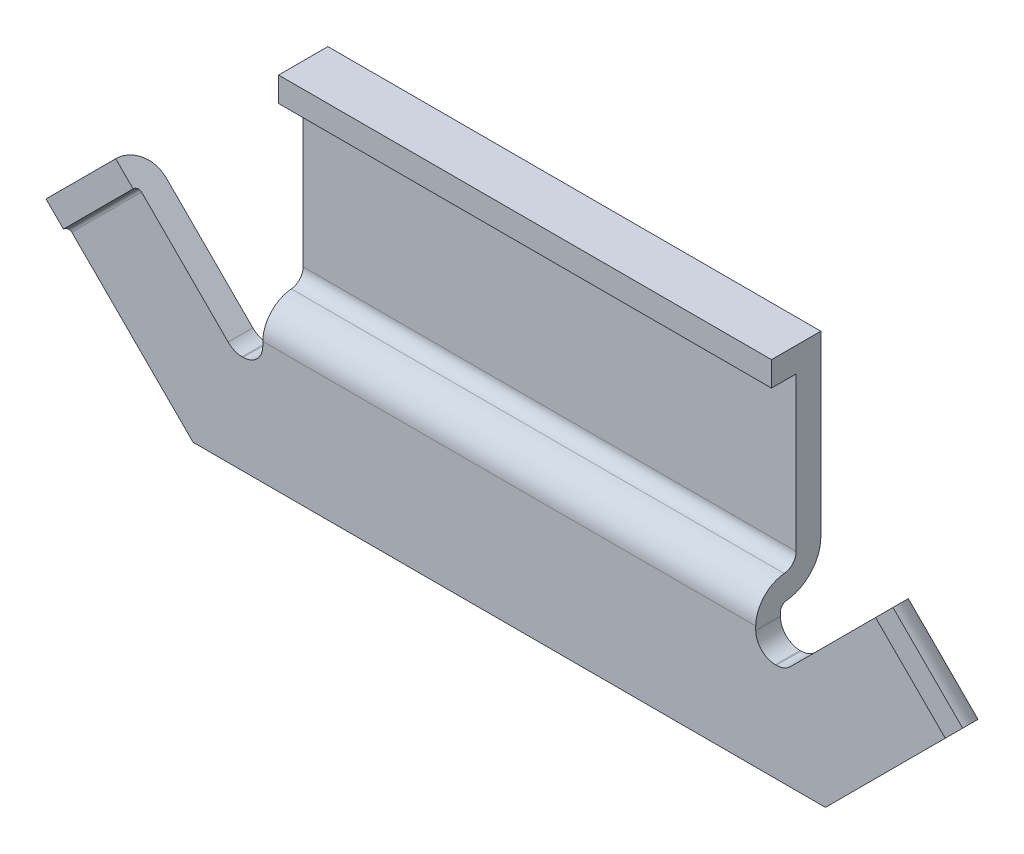
ISO-10303-21;
HEADER;
FILE_DESCRIPTION(('STEP AP214'),'2;1');
FILE_NAME('part.step','',(''),(''),'','','');
FILE_SCHEMA(('AUTOMOTIVE_DESIGN { 1 0 10303 214 1 1 1 1 }'));
ENDSEC;
DATA;
#1=APPLICATION_CONTEXT('core data for automotive mechanical design processes');
#2=APPLICATION_PROTOCOL_DEFINITION('international standard','automotive_design',2000,#1);
#3=PRODUCT_CONTEXT('',#1,'mechanical');
#4=PRODUCT('Part','Part','',(#3));
#5=PRODUCT_RELATED_PRODUCT_CATEGORY('part','',(#4));
#6=PRODUCT_DEFINITION_FORMATION('','',#4);
#7=PRODUCT_DEFINITION_CONTEXT('part definition',#1,'design');
#8=PRODUCT_DEFINITION('design','',#6,#7);
#9=PRODUCT_DEFINITION_SHAPE('','',#8);
#10=(LENGTH_UNIT() NAMED_UNIT(*) SI_UNIT(.MILLI.,.METRE.));
#11=(NAMED_UNIT(*) PLANE_ANGLE_UNIT() SI_UNIT($,.RADIAN.));
#12=(NAMED_UNIT(*) SI_UNIT($,.STERADIAN.) SOLID_ANGLE_UNIT());
#13=UNCERTAINTY_MEASURE_WITH_UNIT(LENGTH_MEASURE(1.E-05),#10,'distance_accuracy_value','');
#14=(GEOMETRIC_REPRESENTATION_CONTEXT(3) GLOBAL_UNCERTAINTY_ASSIGNED_CONTEXT((#13)) GLOBAL_UNIT_ASSIGNED_CONTEXT((#10,
#11,#12)) REPRESENTATION_CONTEXT('',''));
#15=CARTESIAN_POINT('',(0.,0.,0.));
#16=DIRECTION('',(0.,0.,1.));
#17=DIRECTION('',(1.,0.,0.));
#18=AXIS2_PLACEMENT_3D('',#15,#16,#17);
#19=CARTESIAN_POINT('',(2.5,5.75,-0.16));
#20=DIRECTION('',(0.,1.,0.));
#21=DIRECTION('',(0.,0.,1.));
#22=AXIS2_PLACEMENT_3D('',#19,#20,#21);
#23=PLANE('',#22);
#24=DIRECTION('',(1.,0.,0.));
#25=VECTOR('',#24,1.);
#26=CARTESIAN_POINT('',(2.5,5.75,-0.159999999999997));
#27=LINE('',#26,#25);
#28=CARTESIAN_POINT('',(-2.5,5.75,-0.159999999999999));
#29=VERTEX_POINT('',#28);
#30=CARTESIAN_POINT('',(2.5,5.75,-0.159999999999999));
#31=VERTEX_POINT('',#30);
#32=EDGE_CURVE('E275',#29,#31,#27,.T.);
#33=ORIENTED_EDGE('',*,*,#32,.T.);
#34=DIRECTION('',(0.,0.,1.));
#35=VECTOR('',#34,1.);
#36=CARTESIAN_POINT('',(2.5,5.75,-0.16));
#37=LINE('',#36,#35);
#38=CARTESIAN_POINT('',(2.5,5.75,0.09));
#39=VERTEX_POINT('',#38);
#40=EDGE_CURVE('E322',#39,#31,#37,.F.);
#41=ORIENTED_EDGE('',*,*,#40,.F.);
#42=DIRECTION('',(1.,0.,0.));
#43=VECTOR('',#42,1.);
#44=CARTESIAN_POINT('',(2.5,5.75,0.09));
#45=LINE('',#44,#43);
#46=CARTESIAN_POINT('',(-2.5,5.75,0.09));
#47=VERTEX_POINT('',#46);
#48=EDGE_CURVE('E310',#39,#47,#45,.F.);
#49=ORIENTED_EDGE('',*,*,#48,.T.);
#50=DIRECTION('',(0.,0.,1.));
#51=VECTOR('',#50,1.);
#52=CARTESIAN_POINT('',(-2.5,5.75,-0.16));
#53=LINE('',#52,#51);
#54=EDGE_CURVE('E317',#29,#47,#53,.T.);
#55=ORIENTED_EDGE('',*,*,#54,.F.);
#56=EDGE_LOOP('',(#33,#41,#49,#55));
#57=FACE_BOUND('',#56,.T.);
#58=ADVANCED_FACE('F17',(#57),#23,.F.);
#59=CARTESIAN_POINT('',(2.5,5.75,0.09));
#60=DIRECTION('',(0.,0.,-1.));
#61=DIRECTION('',(0.,1.,0.));
#62=AXIS2_PLACEMENT_3D('',#59,#60,#61);
#63=PLANE('',#62);
#64=ORIENTED_EDGE('',*,*,#48,.F.);
#65=DIRECTION('',(0.,1.,0.));
#66=VECTOR('',#65,1.);
#67=CARTESIAN_POINT('',(2.5,3.7,0.09));
#68=LINE('',#67,#66);
#69=CARTESIAN_POINT('',(2.5,6.,0.09));
#70=VERTEX_POINT('',#69);
#71=EDGE_CURVE('E259',#70,#39,#68,.F.);
#72=ORIENTED_EDGE('',*,*,#71,.F.);
#73=DIRECTION('',(1.,0.,0.));
#74=VECTOR('',#73,1.);
#75=CARTESIAN_POINT('',(2.5,6.,0.09));
#76=LINE('',#75,#74);
#77=CARTESIAN_POINT('',(-2.5,6.,0.09));
#78=VERTEX_POINT('',#77);
#79=EDGE_CURVE('E290',#70,#78,#76,.F.);
#80=ORIENTED_EDGE('',*,*,#79,.T.);
#81=DIRECTION('',(0.,1.,0.));
#82=VECTOR('',#81,1.);
#83=CARTESIAN_POINT('',(-2.5,5.75,0.09));
#84=LINE('',#83,#82);
#85=EDGE_CURVE('E298',#47,#78,#84,.T.);
#86=ORIENTED_EDGE('',*,*,#85,.F.);
#87=EDGE_LOOP('',(#64,#72,#80,#86));
#88=FACE_BOUND('',#87,.T.);
#89=ADVANCED_FACE('F526',(#88),#63,.F.);
#90=CARTESIAN_POINT('',(2.5,4.19,-0.16));
#91=DIRECTION('',(0.,0.,-1.));
#92=DIRECTION('',(0.,1.,0.));
#93=AXIS2_PLACEMENT_3D('',#90,#91,#92);
#94=PLANE('',#93);
#95=DIRECTION('',(1.,0.,0.));
#96=VECTOR('',#95,1.);
#97=CARTESIAN_POINT('',(2.5,4.19,-0.16000000000022));
#98=LINE('',#97,#96);
#99=CARTESIAN_POINT('',(-2.5,4.19,-0.16000000000011));
#100=VERTEX_POINT('',#99);
#101=CARTESIAN_POINT('',(2.5,4.19,-0.16000000000011));
#102=VERTEX_POINT('',#101);
#103=EDGE_CURVE('E245',#100,#102,#98,.T.);
#104=ORIENTED_EDGE('',*,*,#103,.T.);
#105=DIRECTION('',(0.,1.,0.));
#106=VECTOR('',#105,1.);
#107=CARTESIAN_POINT('',(2.5,3.7,-0.16));
#108=LINE('',#107,#106);
#109=EDGE_CURVE('E257',#31,#102,#108,.F.);
#110=ORIENTED_EDGE('',*,*,#109,.F.);
#111=ORIENTED_EDGE('',*,*,#32,.F.);
#112=DIRECTION('',(0.,-1.,0.));
#113=VECTOR('',#112,1.);
#114=CARTESIAN_POINT('',(-2.5,3.7,-0.16));
#115=LINE('',#114,#113);
#116=EDGE_CURVE('E253',#100,#29,#115,.F.);
#117=ORIENTED_EDGE('',*,*,#116,.F.);
#118=EDGE_LOOP('',(#104,#110,#111,#117));
#119=FACE_BOUND('',#118,.T.);
#120=ADVANCED_FACE('F456',(#119),#94,.F.);
#121=CARTESIAN_POINT('',(2.5,3.7,0.));
#122=DIRECTION('',(1.,0.,0.));
#123=DIRECTION('',(0.,1.,0.));
#124=AXIS2_PLACEMENT_3D('',#121,#122,#123);
#125=PLANE('',#124);
#126=CARTESIAN_POINT('',(2.5,4.19,-0.02645889627922));
#127=DIRECTION('',(1.,0.,0.));
#128=DIRECTION('',(0.,0.,-1.));
#129=AXIS2_PLACEMENT_3D('',#126,#127,#128);
#130=CIRCLE('',#129,0.133541103721);
#131=CARTESIAN_POINT('',(2.5,4.05703543639201,-0.0388545087131117));
#132=VERTEX_POINT('',#131);
#133=EDGE_CURVE('E242',#102,#132,#130,.F.);
#134=ORIENTED_EDGE('',*,*,#133,.T.);
#135=CARTESIAN_POINT('',(2.5,3.74,-0.06841011579141));
#136=DIRECTION('',(1.,0.,0.));
#137=DIRECTION('',(0.,0.,-1.));
#138=AXIS2_PLACEMENT_3D('',#135,#136,#137);
#139=CIRCLE('',#138,0.318410115791);
#140=CARTESIAN_POINT('',(2.5,3.74,0.25));
#141=VERTEX_POINT('',#140);
#142=EDGE_CURVE('E255',#132,#141,#139,.T.);
#143=ORIENTED_EDGE('',*,*,#142,.T.);
#144=DIRECTION('',(0.,1.,0.));
#145=VECTOR('',#144,1.);
#146=CARTESIAN_POINT('',(2.5,3.7,0.25));
#147=LINE('',#146,#145);
#148=CARTESIAN_POINT('',(2.5,3.7,0.25));
#149=VERTEX_POINT('',#148);
#150=EDGE_CURVE('E268',#141,#149,#147,.F.);
#151=ORIENTED_EDGE('',*,*,#150,.T.);
#152=DIRECTION('',(0.,0.,1.));
#153=VECTOR('',#152,1.);
#154=CARTESIAN_POINT('',(2.5,3.7,0.));
#155=LINE('',#154,#153);
#156=CARTESIAN_POINT('',(2.5,3.7,0.));
#157=VERTEX_POINT('',#156);
#158=EDGE_CURVE('E154',#149,#157,#155,.F.);
#159=ORIENTED_EDGE('',*,*,#158,.T.);
#160=DIRECTION('',(0.,1.,0.));
#161=VECTOR('',#160,1.);
#162=CARTESIAN_POINT('',(2.5,3.7,0.));
#163=LINE('',#162,#161);
#164=CARTESIAN_POINT('',(2.5,3.74,0.));
#165=VERTEX_POINT('',#164);
#166=EDGE_CURVE('E149',#157,#165,#163,.T.);
#167=ORIENTED_EDGE('',*,*,#166,.T.);
#168=CARTESIAN_POINT('',(2.5,3.74,-0.06841011579141));
#169=DIRECTION('',(1.,0.,0.));
#170=DIRECTION('',(0.,0.,-1.));
#171=AXIS2_PLACEMENT_3D('',#168,#169,#170);
#172=CIRCLE('',#171,0.06841011579141);
#173=CARTESIAN_POINT('',(2.5,3.80811476720731,-0.0620601212333158));
#174=VERTEX_POINT('',#173);
#175=EDGE_CURVE('E20',#165,#174,#172,.F.);
#176=ORIENTED_EDGE('',*,*,#175,.T.);
#177=CARTESIAN_POINT('',(2.5,4.19,-0.02645889627922));
#178=DIRECTION('',(1.,0.,0.));
#179=DIRECTION('',(0.,0.,-1.));
#180=AXIS2_PLACEMENT_3D('',#177,#178,#179);
#181=CIRCLE('',#180,0.383541103721);
#182=CARTESIAN_POINT('',(2.5,4.19,-0.41000000000011));
#183=VERTEX_POINT('',#182);
#184=EDGE_CURVE('E258',#174,#183,#181,.T.);
#185=ORIENTED_EDGE('',*,*,#184,.T.);
#186=DIRECTION('',(0.,-1.,0.));
#187=VECTOR('',#186,1.);
#188=CARTESIAN_POINT('',(2.5,4.19,-0.41));
#189=LINE('',#188,#187);
#190=CARTESIAN_POINT('',(2.5,6.,-0.409999999999997));
#191=VERTEX_POINT('',#190);
#192=EDGE_CURVE('E241',#183,#191,#189,.F.);
#193=ORIENTED_EDGE('',*,*,#192,.T.);
#194=DIRECTION('',(0.,0.,-1.));
#195=VECTOR('',#194,1.);
#196=CARTESIAN_POINT('',(2.5,6.,0.09));
#197=LINE('',#196,#195);
#198=EDGE_CURVE('E256',#191,#70,#197,.F.);
#199=ORIENTED_EDGE('',*,*,#198,.T.);
#200=ORIENTED_EDGE('',*,*,#71,.T.);
#201=ORIENTED_EDGE('',*,*,#40,.T.);
#202=ORIENTED_EDGE('',*,*,#109,.T.);
#203=EDGE_LOOP('',(#134,#143,#151,#159,#167,#176,#185,#193,#199,#200,#201,#202));
#204=FACE_BOUND('',#203,.T.);
#205=ADVANCED_FACE('F446',(#204),#125,.T.);
#206=CARTESIAN_POINT('',(2.5,6.,0.09));
#207=DIRECTION('',(0.,-1.,0.));
#208=DIRECTION('',(0.,0.,-1.));
#209=AXIS2_PLACEMENT_3D('',#206,#207,#208);
#210=PLANE('',#209);
#211=ORIENTED_EDGE('',*,*,#79,.F.);
#212=ORIENTED_EDGE('',*,*,#198,.F.);
#213=DIRECTION('',(1.,0.,0.));
#214=VECTOR('',#213,1.);
#215=CARTESIAN_POINT('',(2.5,6.,-0.409999999999997));
#216=LINE('',#215,#214);
#217=CARTESIAN_POINT('',(-2.5,6.,-0.409999999999997));
#218=VERTEX_POINT('',#217);
#219=EDGE_CURVE('E425',#191,#218,#216,.F.);
#220=ORIENTED_EDGE('',*,*,#219,.T.);
#221=DIRECTION('',(0.,0.,1.));
#222=VECTOR('',#221,1.);
#223=CARTESIAN_POINT('',(-2.5,6.,0.25));
#224=LINE('',#223,#222);
#225=EDGE_CURVE('E250',#78,#218,#224,.F.);
#226=ORIENTED_EDGE('',*,*,#225,.F.);
#227=EDGE_LOOP('',(#211,#212,#220,#226));
#228=FACE_BOUND('',#227,.T.);
#229=ADVANCED_FACE('F523',(#228),#210,.F.);
#230=CARTESIAN_POINT('',(-2.5,3.7,0.25));
#231=DIRECTION('',(-1.,0.,0.));
#232=DIRECTION('',(0.,-1.,0.));
#233=AXIS2_PLACEMENT_3D('',#230,#231,#232);
#234=PLANE('',#233);
#235=CARTESIAN_POINT('',(-2.5,4.19,-0.02645889627922));
#236=DIRECTION('',(1.,0.,0.));
#237=DIRECTION('',(0.,0.,-1.));
#238=AXIS2_PLACEMENT_3D('',#235,#236,#237);
#239=CIRCLE('',#238,0.383541103721);
#240=CARTESIAN_POINT('',(-2.5,4.19,-0.41000000000011));
#241=VERTEX_POINT('',#240);
#242=CARTESIAN_POINT('',(-2.5,3.80811476720721,-0.0620601212333258));
#243=VERTEX_POINT('',#242);
#244=EDGE_CURVE('E248',#241,#243,#239,.F.);
#245=ORIENTED_EDGE('',*,*,#244,.T.);
#246=CARTESIAN_POINT('',(-2.5,3.74,-0.06841011579141));
#247=DIRECTION('',(1.,0.,0.));
#248=DIRECTION('',(0.,0.,-1.));
#249=AXIS2_PLACEMENT_3D('',#246,#247,#248);
#250=CIRCLE('',#249,0.06841011579141);
#251=CARTESIAN_POINT('',(-2.5,3.74,0.));
#252=VERTEX_POINT('',#251);
#253=EDGE_CURVE('E246',#243,#252,#250,.T.);
#254=ORIENTED_EDGE('',*,*,#253,.T.);
#255=DIRECTION('',(0.,-1.,0.));
#256=VECTOR('',#255,1.);
#257=CARTESIAN_POINT('',(-2.5,3.7,0.));
#258=LINE('',#257,#256);
#259=CARTESIAN_POINT('',(-2.5,3.7,0.));
#260=VERTEX_POINT('',#259);
#261=EDGE_CURVE('E293',#252,#260,#258,.T.);
#262=ORIENTED_EDGE('',*,*,#261,.T.);
#263=DIRECTION('',(0.,0.,1.));
#264=VECTOR('',#263,1.);
#265=CARTESIAN_POINT('',(-2.5,3.7,0.25));
#266=LINE('',#265,#264);
#267=CARTESIAN_POINT('',(-2.5,3.7,0.25));
#268=VERTEX_POINT('',#267);
#269=EDGE_CURVE('E306',#260,#268,#266,.T.);
#270=ORIENTED_EDGE('',*,*,#269,.T.);
#271=DIRECTION('',(0.,-1.,0.));
#272=VECTOR('',#271,1.);
#273=CARTESIAN_POINT('',(-2.5,3.7,0.25));
#274=LINE('',#273,#272);
#275=CARTESIAN_POINT('',(-2.5,3.74,0.25));
#276=VERTEX_POINT('',#275);
#277=EDGE_CURVE('E254',#268,#276,#274,.F.);
#278=ORIENTED_EDGE('',*,*,#277,.T.);
#279=CARTESIAN_POINT('',(-2.5,3.74,-0.06841011579141));
#280=DIRECTION('',(1.,0.,0.));
#281=DIRECTION('',(0.,0.,-1.));
#282=AXIS2_PLACEMENT_3D('',#279,#280,#281);
#283=CIRCLE('',#282,0.318410115791);
#284=CARTESIAN_POINT('',(-2.5,4.05703543639201,-0.0388545087131117));
#285=VERTEX_POINT('',#284);
#286=EDGE_CURVE('E251',#276,#285,#283,.F.);
#287=ORIENTED_EDGE('',*,*,#286,.T.);
#288=CARTESIAN_POINT('',(-2.5,4.19,-0.02645889627922));
#289=DIRECTION('',(1.,0.,0.));
#290=DIRECTION('',(0.,0.,-1.));
#291=AXIS2_PLACEMENT_3D('',#288,#289,#290);
#292=CIRCLE('',#291,0.133541103721);
#293=EDGE_CURVE('E238',#285,#100,#292,.T.);
#294=ORIENTED_EDGE('',*,*,#293,.T.);
#295=ORIENTED_EDGE('',*,*,#116,.T.);
#296=ORIENTED_EDGE('',*,*,#54,.T.);
#297=ORIENTED_EDGE('',*,*,#85,.T.);
#298=ORIENTED_EDGE('',*,*,#225,.T.);
#299=DIRECTION('',(0.,-1.,0.));
#300=VECTOR('',#299,1.);
#301=CARTESIAN_POINT('',(-2.5,4.19,-0.41));
#302=LINE('',#301,#300);
#303=EDGE_CURVE('E280',#218,#241,#302,.T.);
#304=ORIENTED_EDGE('',*,*,#303,.T.);
#305=EDGE_LOOP('',(#245,#254,#262,#270,#278,#287,#294,#295,#296,#297,#298,#304));
#306=FACE_BOUND('',#305,.T.);
#307=ADVANCED_FACE('F458',(#306),#234,.T.);
#308=CARTESIAN_POINT('',(2.5,4.19,-0.02645889627922));
#309=DIRECTION('',(1.,0.,0.));
#310=DIRECTION('',(0.,0.,-1.));
#311=AXIS2_PLACEMENT_3D('',#308,#309,#310);
#312=CYLINDRICAL_SURFACE('',#311,0.133541103721);
#313=DIRECTION('',(1.,0.,0.));
#314=VECTOR('',#313,1.);
#315=CARTESIAN_POINT('',(2.5,4.05703543639201,-0.0388545087130894));
#316=LINE('',#315,#314);
#317=EDGE_CURVE('E276',#132,#285,#316,.F.);
#318=ORIENTED_EDGE('',*,*,#317,.F.);
#319=ORIENTED_EDGE('',*,*,#133,.F.);
#320=ORIENTED_EDGE('',*,*,#103,.F.);
#321=ORIENTED_EDGE('',*,*,#293,.F.);
#322=EDGE_LOOP('',(#318,#319,#320,#321));
#323=FACE_BOUND('',#322,.T.);
#324=ADVANCED_FACE('F453',(#323),#312,.F.);
#325=CARTESIAN_POINT('',(2.5,4.19,-0.41));
#326=DIRECTION('',(0.,0.,1.));
#327=DIRECTION('',(0.,-1.,0.));
#328=AXIS2_PLACEMENT_3D('',#325,#326,#327);
#329=PLANE('',#328);
#330=ORIENTED_EDGE('',*,*,#219,.F.);
#331=ORIENTED_EDGE('',*,*,#192,.F.);
#332=DIRECTION('',(1.,0.,0.));
#333=VECTOR('',#332,1.);
#334=CARTESIAN_POINT('',(2.5,4.19,-0.41000000000022));
#335=LINE('',#334,#333);
#336=EDGE_CURVE('E279',#241,#183,#335,.T.);
#337=ORIENTED_EDGE('',*,*,#336,.F.);
#338=ORIENTED_EDGE('',*,*,#303,.F.);
#339=EDGE_LOOP('',(#330,#331,#337,#338));
#340=FACE_BOUND('',#339,.T.);
#341=ADVANCED_FACE('F486',(#340),#329,.F.);
#342=CARTESIAN_POINT('',(2.5,3.74,-0.06841011579141));
#343=DIRECTION('',(1.,0.,0.));
#344=DIRECTION('',(0.,0.,-1.));
#345=AXIS2_PLACEMENT_3D('',#342,#343,#344);
#346=CYLINDRICAL_SURFACE('',#345,0.318410115791);
#347=ORIENTED_EDGE('',*,*,#142,.F.);
#348=ORIENTED_EDGE('',*,*,#317,.T.);
#349=ORIENTED_EDGE('',*,*,#286,.F.);
#350=DIRECTION('',(1.,0.,0.));
#351=VECTOR('',#350,1.);
#352=CARTESIAN_POINT('',(0.,3.74,0.25));
#353=LINE('',#352,#351);
#354=EDGE_CURVE('E301',#141,#276,#353,.F.);
#355=ORIENTED_EDGE('',*,*,#354,.F.);
#356=EDGE_LOOP('',(#347,#348,#349,#355));
#357=FACE_BOUND('',#356,.T.);
#358=ADVANCED_FACE('F461',(#357),#346,.T.);
#359=CARTESIAN_POINT('',(2.5,4.19,-0.02645889627922));
#360=DIRECTION('',(1.,0.,0.));
#361=DIRECTION('',(0.,0.,-1.));
#362=AXIS2_PLACEMENT_3D('',#359,#360,#361);
#363=CYLINDRICAL_SURFACE('',#362,0.383541103721);
#364=ORIENTED_EDGE('',*,*,#184,.F.);
#365=DIRECTION('',(1.,0.,0.));
#366=VECTOR('',#365,1.);
#367=CARTESIAN_POINT('',(2.5,3.80811476720731,-0.062060121233301));
#368=LINE('',#367,#366);
#369=EDGE_CURVE('E225',#174,#243,#368,.F.);
#370=ORIENTED_EDGE('',*,*,#369,.T.);
#371=ORIENTED_EDGE('',*,*,#244,.F.);
#372=ORIENTED_EDGE('',*,*,#336,.T.);
#373=EDGE_LOOP('',(#364,#370,#371,#372));
#374=FACE_BOUND('',#373,.T.);
#375=ADVANCED_FACE('F481',(#374),#363,.T.);
#376=CARTESIAN_POINT('',(-3.765343609818,4.472450391005,0.3));
#377=DIRECTION('',(0.,0.,-1.));
#378=DIRECTION('',(-1.,0.,0.));
#379=AXIS2_PLACEMENT_3D('',#376,#377,#378);
#380=PLANE('',#379);
#381=DIRECTION('',(0.707106781186548,0.707106781186548,0.));
#382=VECTOR('',#381,1.);
#383=CARTESIAN_POINT('',(-3.76534360981833,4.47245039100533,0.3));
#384=LINE('',#383,#382);
#385=CARTESIAN_POINT('',(-4.47245039100533,3.76534360981833,0.3));
#386=VERTEX_POINT('',#385);
#387=CARTESIAN_POINT('',(-3.76534360981833,4.47245039100533,0.3));
#388=VERTEX_POINT('',#387);
#389=EDGE_CURVE('E305',#386,#388,#384,.T.);
#390=ORIENTED_EDGE('',*,*,#389,.T.);
#391=DIRECTION('',(0.707106781186548,-0.707106781186548,0.));
#392=VECTOR('',#391,1.);
#393=CARTESIAN_POINT('',(-4.267766952966,4.974873734153,0.3));
#394=LINE('',#393,#392);
#395=CARTESIAN_POINT('',(-3.94212030511496,4.64922708630196,0.3));
#396=VERTEX_POINT('',#395);
#397=EDGE_CURVE('E216',#388,#396,#394,.F.);
#398=ORIENTED_EDGE('',*,*,#397,.T.);
#399=DIRECTION('',(0.707106781186548,0.707106781186548,0.));
#400=VECTOR('',#399,1.);
#401=CARTESIAN_POINT('',(-3.94212030511496,4.64922708630196,0.3));
#402=LINE('',#401,#400);
#403=CARTESIAN_POINT('',(-4.64922708630196,3.94212030511496,0.3));
#404=VERTEX_POINT('',#403);
#405=EDGE_CURVE('E212',#404,#396,#402,.T.);
#406=ORIENTED_EDGE('',*,*,#405,.F.);
#407=DIRECTION('',(-0.707106781186548,0.707106781186548,0.));
#408=VECTOR('',#407,1.);
#409=CARTESIAN_POINT('',(-3.207106781187,2.5,0.3));
#410=LINE('',#409,#408);
#411=EDGE_CURVE('E206',#404,#386,#410,.F.);
#412=ORIENTED_EDGE('',*,*,#411,.T.);
#413=EDGE_LOOP('',(#390,#398,#406,#412));
#414=FACE_BOUND('',#413,.T.);
#415=ADVANCED_FACE('F591',(#414),#380,.F.);
#416=CARTESIAN_POINT('',(-3.729988270759,4.437095051946,0.3));
#417=DIRECTION('',(0.707106781186548,0.707106781186548,0.));
#418=DIRECTION('',(-0.707106781186548,0.707106781186548,0.));
#419=AXIS2_PLACEMENT_3D('',#416,#417,#418);
#420=CYLINDRICAL_SURFACE('',#419,0.05);
#421=DIRECTION('',(-0.707106781186547,-0.707106781186548,0.));
#422=VECTOR('',#421,1.);
#423=CARTESIAN_POINT('',(-3.729988270759,4.437095051946,0.25));
#424=LINE('',#423,#422);
#425=CARTESIAN_POINT('',(-3.729988270759,4.437095051946,0.25));
#426=VERTEX_POINT('',#425);
#427=CARTESIAN_POINT('',(-4.437095051946,3.729988270759,0.25));
#428=VERTEX_POINT('',#427);
#429=EDGE_CURVE('E304',#426,#428,#424,.T.);
#430=ORIENTED_EDGE('',*,*,#429,.F.);
#431=CARTESIAN_POINT('',(-3.729988270759,4.437095051946,0.3));
#432=DIRECTION('',(0.707106781186548,0.707106781186548,0.));
#433=DIRECTION('',(-0.707106781186548,0.707106781186548,0.));
#434=AXIS2_PLACEMENT_3D('',#431,#432,#433);
#435=CIRCLE('',#434,0.05);
#436=EDGE_CURVE('E213',#426,#388,#435,.T.);
#437=ORIENTED_EDGE('',*,*,#436,.T.);
#438=ORIENTED_EDGE('',*,*,#389,.F.);
#439=CARTESIAN_POINT('',(-4.437095051946,3.729988270759,0.3));
#440=DIRECTION('',(0.707106781186548,0.707106781186548,0.));
#441=DIRECTION('',(-0.707106781186548,0.707106781186548,0.));
#442=AXIS2_PLACEMENT_3D('',#439,#440,#441);
#443=CIRCLE('',#442,0.05);
#444=EDGE_CURVE('E202',#386,#428,#443,.F.);
#445=ORIENTED_EDGE('',*,*,#444,.T.);
#446=EDGE_LOOP('',(#430,#437,#438,#445));
#447=FACE_BOUND('',#446,.T.);
#448=ADVANCED_FACE('F588',(#447),#420,.F.);
#449=CARTESIAN_POINT('',(0.,-0.707106781187,0.25));
#450=DIRECTION('',(0.,0.,1.));
#451=DIRECTION('',(1.,0.,0.));
#452=AXIS2_PLACEMENT_3D('',#449,#450,#451);
#453=PLANE('',#452);
#454=DIRECTION('',(-0.707106781186548,0.707106781186548,0.));
#455=VECTOR('',#454,1.);
#456=CARTESIAN_POINT('',(-3.207106781187,2.5,0.25));
#457=LINE('',#456,#455);
#458=CARTESIAN_POINT('',(-3.207106781187,2.5,0.25));
#459=VERTEX_POINT('',#458);
#460=EDGE_CURVE('E205',#428,#459,#457,.F.);
#461=ORIENTED_EDGE('',*,*,#460,.T.);
#462=DIRECTION('',(1.,0.,0.));
#463=VECTOR('',#462,1.);
#464=CARTESIAN_POINT('',(-3.207106781187,2.5,0.25));
#465=LINE('',#464,#463);
#466=CARTESIAN_POINT('',(3.207106781187,2.5,0.25));
#467=VERTEX_POINT('',#466);
#468=EDGE_CURVE('E360',#459,#467,#465,.T.);
#469=ORIENTED_EDGE('',*,*,#468,.T.);
#470=DIRECTION('',(-0.707106781186548,-0.707106781186548,0.));
#471=VECTOR('',#470,1.);
#472=CARTESIAN_POINT('',(3.207106781187,2.5,0.25));
#473=LINE('',#472,#471);
#474=CARTESIAN_POINT('',(4.437095051946,3.729988270759,0.25));
#475=VERTEX_POINT('',#474);
#476=EDGE_CURVE('E201',#467,#475,#473,.F.);
#477=ORIENTED_EDGE('',*,*,#476,.T.);
#478=DIRECTION('',(-0.707106781186548,0.707106781186548,0.));
#479=VECTOR('',#478,1.);
#480=CARTESIAN_POINT('',(3.729988270759,4.437095051946,0.25));
#481=LINE('',#480,#479);
#482=CARTESIAN_POINT('',(3.729988270759,4.437095051946,0.25));
#483=VERTEX_POINT('',#482);
#484=EDGE_CURVE('E405',#475,#483,#481,.T.);
#485=ORIENTED_EDGE('',*,*,#484,.T.);
#486=DIRECTION('',(0.707106781186548,0.707106781186548,0.));
#487=VECTOR('',#486,1.);
#488=CARTESIAN_POINT('',(4.267766952966,4.974873734153,0.25));
#489=LINE('',#488,#487);
#490=CARTESIAN_POINT('',(2.85147186257616,3.55857864376285,0.25));
#491=VERTEX_POINT('',#490);
#492=EDGE_CURVE('E237',#483,#491,#489,.F.);
#493=ORIENTED_EDGE('',*,*,#492,.T.);
#494=CARTESIAN_POINT('',(2.710050506339,3.7,0.25));
#495=DIRECTION('',(0.,0.,-1.));
#496=DIRECTION('',(-1.,0.,0.));
#497=AXIS2_PLACEMENT_3D('',#494,#495,#496);
#498=CIRCLE('',#497,0.2);
#499=CARTESIAN_POINT('',(2.710050506339,3.5,0.25));
#500=VERTEX_POINT('',#499);
#501=EDGE_CURVE('E230',#491,#500,#498,.T.);
#502=ORIENTED_EDGE('',*,*,#501,.T.);
#503=DIRECTION('',(1.,0.,0.));
#504=VECTOR('',#503,1.);
#505=CARTESIAN_POINT('',(2.792893218813,3.5,0.25));
#506=LINE('',#505,#504);
#507=CARTESIAN_POINT('',(2.7,3.5,0.25));
#508=VERTEX_POINT('',#507);
#509=EDGE_CURVE('E399',#500,#508,#506,.F.);
#510=ORIENTED_EDGE('',*,*,#509,.T.);
#511=CARTESIAN_POINT('',(2.7,3.7,0.25));
#512=DIRECTION('',(0.,0.,-1.));
#513=DIRECTION('',(-1.,0.,0.));
#514=AXIS2_PLACEMENT_3D('',#511,#512,#513);
#515=CIRCLE('',#514,0.2);
#516=EDGE_CURVE('E226',#508,#149,#515,.T.);
#517=ORIENTED_EDGE('',*,*,#516,.T.);
#518=ORIENTED_EDGE('',*,*,#150,.F.);
#519=ORIENTED_EDGE('',*,*,#354,.T.);
#520=ORIENTED_EDGE('',*,*,#277,.F.);
#521=CARTESIAN_POINT('',(-2.7,3.7,0.25));
#522=DIRECTION('',(0.,0.,1.));
#523=DIRECTION('',(1.,0.,0.));
#524=AXIS2_PLACEMENT_3D('',#521,#522,#523);
#525=CIRCLE('',#524,0.2);
#526=CARTESIAN_POINT('',(-2.7,3.5,0.25));
#527=VERTEX_POINT('',#526);
#528=EDGE_CURVE('E222',#268,#527,#525,.F.);
#529=ORIENTED_EDGE('',*,*,#528,.T.);
#530=DIRECTION('',(1.,0.,0.));
#531=VECTOR('',#530,1.);
#532=CARTESIAN_POINT('',(2.792893218813,3.5,0.25));
#533=LINE('',#532,#531);
#534=CARTESIAN_POINT('',(-2.710050506339,3.5,0.25));
#535=VERTEX_POINT('',#534);
#536=EDGE_CURVE('E394',#527,#535,#533,.F.);
#537=ORIENTED_EDGE('',*,*,#536,.T.);
#538=CARTESIAN_POINT('',(-2.710050506339,3.7,0.25));
#539=DIRECTION('',(0.,0.,-1.));
#540=DIRECTION('',(-1.,0.,0.));
#541=AXIS2_PLACEMENT_3D('',#538,#539,#540);
#542=CIRCLE('',#541,0.2);
#543=CARTESIAN_POINT('',(-2.851471862576,3.558578643763,0.25));
#544=VERTEX_POINT('',#543);
#545=EDGE_CURVE('E218',#535,#544,#542,.T.);
#546=ORIENTED_EDGE('',*,*,#545,.T.);
#547=DIRECTION('',(0.707106781186548,-0.707106781186548,0.));
#548=VECTOR('',#547,1.);
#549=CARTESIAN_POINT('',(-4.267766952966,4.974873734153,0.25));
#550=LINE('',#549,#548);
#551=EDGE_CURVE('E217',#544,#426,#550,.F.);
#552=ORIENTED_EDGE('',*,*,#551,.T.);
#553=ORIENTED_EDGE('',*,*,#429,.T.);
#554=EDGE_LOOP('',(#461,#469,#477,#485,#493,#502,#510,#517,#518,#519,#520,#529,#537,#546,#552,#553));
#555=FACE_BOUND('',#554,.T.);
#556=ADVANCED_FACE('F466',(#555),#453,.T.);
#557=CARTESIAN_POINT('',(3.729988270759,4.437095051946,0.3));
#558=DIRECTION('',(-0.707106781186548,0.707106781186548,0.));
#559=DIRECTION('',(-0.707106781186548,-0.707106781186548,0.));
#560=AXIS2_PLACEMENT_3D('',#557,#558,#559);
#561=CYLINDRICAL_SURFACE('',#560,0.05);
#562=DIRECTION('',(-0.707106781186548,0.707106781186548,0.));
#563=VECTOR('',#562,1.);
#564=CARTESIAN_POINT('',(4.472450391005,3.765343609818,0.3));
#565=LINE('',#564,#563);
#566=CARTESIAN_POINT('',(4.47245039100516,3.76534360981816,0.3));
#567=VERTEX_POINT('',#566);
#568=CARTESIAN_POINT('',(3.76534360981816,4.47245039100516,0.3));
#569=VERTEX_POINT('',#568);
#570=EDGE_CURVE('E183',#567,#569,#565,.T.);
#571=ORIENTED_EDGE('',*,*,#570,.T.);
#572=CARTESIAN_POINT('',(3.729988270759,4.437095051946,0.3));
#573=DIRECTION('',(-0.707106781186548,0.707106781186548,0.));
#574=DIRECTION('',(-0.707106781186548,-0.707106781186548,0.));
#575=AXIS2_PLACEMENT_3D('',#572,#573,#574);
#576=CIRCLE('',#575,0.05);
#577=EDGE_CURVE('E234',#569,#483,#576,.T.);
#578=ORIENTED_EDGE('',*,*,#577,.T.);
#579=ORIENTED_EDGE('',*,*,#484,.F.);
#580=CARTESIAN_POINT('',(4.437095051946,3.729988270759,0.3));
#581=DIRECTION('',(-0.707106781186548,0.707106781186548,0.));
#582=DIRECTION('',(-0.707106781186548,-0.707106781186548,0.));
#583=AXIS2_PLACEMENT_3D('',#580,#581,#582);
#584=CIRCLE('',#583,0.05);
#585=EDGE_CURVE('E187',#475,#567,#584,.F.);
#586=ORIENTED_EDGE('',*,*,#585,.T.);
#587=EDGE_LOOP('',(#571,#578,#579,#586));
#588=FACE_BOUND('',#587,.T.);
#589=ADVANCED_FACE('F582',(#588),#561,.F.);
#590=CARTESIAN_POINT('',(3.765343609818,4.472450391005,0.3));
#591=DIRECTION('',(0.,0.,-1.));
#592=DIRECTION('',(-1.,0.,0.));
#593=AXIS2_PLACEMENT_3D('',#590,#591,#592);
#594=PLANE('',#593);
#595=DIRECTION('',(-0.707106781186548,0.707106781186548,0.));
#596=VECTOR('',#595,1.);
#597=CARTESIAN_POINT('',(3.94212030511496,4.64922708630196,0.3));
#598=LINE('',#597,#596);
#599=CARTESIAN_POINT('',(3.94212030511496,4.64922708630196,0.3));
#600=VERTEX_POINT('',#599);
#601=CARTESIAN_POINT('',(4.64922708630196,3.94212030511496,0.3));
#602=VERTEX_POINT('',#601);
#603=EDGE_CURVE('E182',#600,#602,#598,.F.);
#604=ORIENTED_EDGE('',*,*,#603,.F.);
#605=DIRECTION('',(0.707106781186548,0.707106781186548,0.));
#606=VECTOR('',#605,1.);
#607=CARTESIAN_POINT('',(4.267766952966,4.974873734153,0.3));
#608=LINE('',#607,#606);
#609=EDGE_CURVE('E174',#600,#569,#608,.F.);
#610=ORIENTED_EDGE('',*,*,#609,.T.);
#611=ORIENTED_EDGE('',*,*,#570,.F.);
#612=DIRECTION('',(-0.707106781186548,-0.707106781186548,0.));
#613=VECTOR('',#612,1.);
#614=CARTESIAN_POINT('',(3.207106781187,2.5,0.3));
#615=LINE('',#614,#613);
#616=EDGE_CURVE('E180',#567,#602,#615,.F.);
#617=ORIENTED_EDGE('',*,*,#616,.T.);
#618=EDGE_LOOP('',(#604,#610,#611,#617));
#619=FACE_BOUND('',#618,.T.);
#620=ADVANCED_FACE('F181',(#619),#594,.F.);
#621=CARTESIAN_POINT('',(4.267766952966,4.974873734153,0.25));
#622=DIRECTION('',(0.707106781186548,-0.707106781186548,0.));
#623=DIRECTION('',(0.707106781186548,0.707106781186548,0.));
#624=AXIS2_PLACEMENT_3D('',#621,#622,#623);
#625=PLANE('',#624);
#626=ORIENTED_EDGE('',*,*,#577,.F.);
#627=ORIENTED_EDGE('',*,*,#609,.F.);
#628=CARTESIAN_POINT('',(3.729988270759,4.437095051946,0.3));
#629=DIRECTION('',(-0.707106781186548,0.707106781186548,0.));
#630=DIRECTION('',(-0.707106781186548,-0.707106781186548,0.));
#631=AXIS2_PLACEMENT_3D('',#628,#629,#630);
#632=CIRCLE('',#631,0.3);
#633=CARTESIAN_POINT('',(3.729988270759,4.437095051946,0.));
#634=VERTEX_POINT('',#633);
#635=EDGE_CURVE('E190',#634,#600,#632,.F.);
#636=ORIENTED_EDGE('',*,*,#635,.F.);
#637=DIRECTION('',(-0.707106781186548,-0.707106781186547,0.));
#638=VECTOR('',#637,1.);
#639=CARTESIAN_POINT('',(3.729988270759,4.437095051946,0.));
#640=LINE('',#639,#638);
#641=CARTESIAN_POINT('',(2.85147186257616,3.55857864376285,0.));
#642=VERTEX_POINT('',#641);
#643=EDGE_CURVE('E191',#634,#642,#640,.T.);
#644=ORIENTED_EDGE('',*,*,#643,.T.);
#645=DIRECTION('',(0.,0.,-1.));
#646=VECTOR('',#645,1.);
#647=CARTESIAN_POINT('',(2.85147186257631,3.55857864376269,0.25));
#648=LINE('',#647,#646);
#649=EDGE_CURVE('E233',#642,#491,#648,.F.);
#650=ORIENTED_EDGE('',*,*,#649,.T.);
#651=ORIENTED_EDGE('',*,*,#492,.F.);
#652=EDGE_LOOP('',(#626,#627,#636,#644,#650,#651));
#653=FACE_BOUND('',#652,.T.);
#654=ADVANCED_FACE('F577',(#653),#625,.F.);
#655=CARTESIAN_POINT('',(2.710050506339,3.7,0.25));
#656=DIRECTION('',(0.,0.,-1.));
#657=DIRECTION('',(-1.,0.,0.));
#658=AXIS2_PLACEMENT_3D('',#655,#656,#657);
#659=CYLINDRICAL_SURFACE('',#658,0.2);
#660=ORIENTED_EDGE('',*,*,#649,.F.);
#661=CARTESIAN_POINT('',(2.710050506339,3.7,0.));
#662=DIRECTION('',(0.,0.,-1.));
#663=DIRECTION('',(-1.,0.,0.));
#664=AXIS2_PLACEMENT_3D('',#661,#662,#663);
#665=CIRCLE('',#664,0.2);
#666=CARTESIAN_POINT('',(2.710050506339,3.5,0.));
#667=VERTEX_POINT('',#666);
#668=EDGE_CURVE('E337',#642,#667,#665,.T.);
#669=ORIENTED_EDGE('',*,*,#668,.T.);
#670=DIRECTION('',(0.,0.,1.));
#671=VECTOR('',#670,1.);
#672=CARTESIAN_POINT('',(2.710050506339,3.5,0.25));
#673=LINE('',#672,#671);
#674=EDGE_CURVE('E232',#667,#500,#673,.T.);
#675=ORIENTED_EDGE('',*,*,#674,.T.);
#676=ORIENTED_EDGE('',*,*,#501,.F.);
#677=EDGE_LOOP('',(#660,#669,#675,#676));
#678=FACE_BOUND('',#677,.T.);
#679=ADVANCED_FACE('F573',(#678),#659,.F.);
#680=CARTESIAN_POINT('',(2.792893218813,3.5,0.25));
#681=DIRECTION('',(0.,-1.,0.));
#682=DIRECTION('',(1.,0.,0.));
#683=AXIS2_PLACEMENT_3D('',#680,#681,#682);
#684=PLANE('',#683);
#685=ORIENTED_EDGE('',*,*,#674,.F.);
#686=DIRECTION('',(1.,0.,0.));
#687=VECTOR('',#686,1.);
#688=CARTESIAN_POINT('',(0.,3.5,0.));
#689=LINE('',#688,#687);
#690=CARTESIAN_POINT('',(2.7,3.5,0.));
#691=VERTEX_POINT('',#690);
#692=EDGE_CURVE('E336',#667,#691,#689,.F.);
#693=ORIENTED_EDGE('',*,*,#692,.T.);
#694=DIRECTION('',(0.,0.,-1.));
#695=VECTOR('',#694,1.);
#696=CARTESIAN_POINT('',(2.7,3.5,0.25));
#697=LINE('',#696,#695);
#698=EDGE_CURVE('E229',#691,#508,#697,.F.);
#699=ORIENTED_EDGE('',*,*,#698,.T.);
#700=ORIENTED_EDGE('',*,*,#509,.F.);
#701=EDGE_LOOP('',(#685,#693,#699,#700));
#702=FACE_BOUND('',#701,.T.);
#703=ADVANCED_FACE('F570',(#702),#684,.F.);
#704=CARTESIAN_POINT('',(2.7,3.7,0.25));
#705=DIRECTION('',(0.,0.,-1.));
#706=DIRECTION('',(-1.,0.,0.));
#707=AXIS2_PLACEMENT_3D('',#704,#705,#706);
#708=CYLINDRICAL_SURFACE('',#707,0.2);
#709=ORIENTED_EDGE('',*,*,#158,.F.);
#710=ORIENTED_EDGE('',*,*,#516,.F.);
#711=ORIENTED_EDGE('',*,*,#698,.F.);
#712=CARTESIAN_POINT('',(2.7,3.7,0.));
#713=DIRECTION('',(0.,0.,-1.));
#714=DIRECTION('',(-1.,0.,0.));
#715=AXIS2_PLACEMENT_3D('',#712,#713,#714);
#716=CIRCLE('',#715,0.2);
#717=EDGE_CURVE('E289',#691,#157,#716,.T.);
#718=ORIENTED_EDGE('',*,*,#717,.T.);
#719=EDGE_LOOP('',(#709,#710,#711,#718));
#720=FACE_BOUND('',#719,.T.);
#721=ADVANCED_FACE('F470',(#720),#708,.F.);
#722=CARTESIAN_POINT('',(2.5,3.74,-0.06841011579141));
#723=DIRECTION('',(1.,0.,0.));
#724=DIRECTION('',(0.,0.,-1.));
#725=AXIS2_PLACEMENT_3D('',#722,#723,#724);
#726=CYLINDRICAL_SURFACE('',#725,0.06841011579141);
#727=ORIENTED_EDGE('',*,*,#369,.F.);
#728=ORIENTED_EDGE('',*,*,#175,.F.);
#729=DIRECTION('',(1.,0.,0.));
#730=VECTOR('',#729,1.);
#731=CARTESIAN_POINT('',(0.,3.74,0.));
#732=LINE('',#731,#730);
#733=EDGE_CURVE('E285',#165,#252,#732,.F.);
#734=ORIENTED_EDGE('',*,*,#733,.T.);
#735=ORIENTED_EDGE('',*,*,#253,.F.);
#736=EDGE_LOOP('',(#727,#728,#734,#735));
#737=FACE_BOUND('',#736,.T.);
#738=ADVANCED_FACE('F479',(#737),#726,.F.);
#739=CARTESIAN_POINT('',(-2.7,3.7,0.25));
#740=DIRECTION('',(0.,0.,1.));
#741=DIRECTION('',(1.,0.,0.));
#742=AXIS2_PLACEMENT_3D('',#739,#740,#741);
#743=CYLINDRICAL_SURFACE('',#742,0.2);
#744=ORIENTED_EDGE('',*,*,#269,.F.);
#745=CARTESIAN_POINT('',(-2.7,3.7,0.));
#746=DIRECTION('',(0.,0.,1.));
#747=DIRECTION('',(1.,0.,0.));
#748=AXIS2_PLACEMENT_3D('',#745,#746,#747);
#749=CIRCLE('',#748,0.2);
#750=CARTESIAN_POINT('',(-2.7,3.5,0.));
#751=VERTEX_POINT('',#750);
#752=EDGE_CURVE('E288',#260,#751,#749,.F.);
#753=ORIENTED_EDGE('',*,*,#752,.T.);
#754=DIRECTION('',(0.,0.,1.));
#755=VECTOR('',#754,1.);
#756=CARTESIAN_POINT('',(-2.7,3.5,0.25));
#757=LINE('',#756,#755);
#758=EDGE_CURVE('E224',#751,#527,#757,.T.);
#759=ORIENTED_EDGE('',*,*,#758,.T.);
#760=ORIENTED_EDGE('',*,*,#528,.F.);
#761=EDGE_LOOP('',(#744,#753,#759,#760));
#762=FACE_BOUND('',#761,.T.);
#763=ADVANCED_FACE('F519',(#762),#743,.F.);
#764=CARTESIAN_POINT('',(2.792893218813,3.5,0.25));
#765=DIRECTION('',(0.,-1.,0.));
#766=DIRECTION('',(1.,0.,0.));
#767=AXIS2_PLACEMENT_3D('',#764,#765,#766);
#768=PLANE('',#767);
#769=DIRECTION('',(0.,0.,-1.));
#770=VECTOR('',#769,1.);
#771=CARTESIAN_POINT('',(-2.710050506339,3.5,0.25));
#772=LINE('',#771,#770);
#773=CARTESIAN_POINT('',(-2.710050506339,3.5,0.));
#774=VERTEX_POINT('',#773);
#775=EDGE_CURVE('E221',#774,#535,#772,.F.);
#776=ORIENTED_EDGE('',*,*,#775,.T.);
#777=ORIENTED_EDGE('',*,*,#536,.F.);
#778=ORIENTED_EDGE('',*,*,#758,.F.);
#779=DIRECTION('',(1.,0.,0.));
#780=VECTOR('',#779,1.);
#781=CARTESIAN_POINT('',(0.,3.5,0.));
#782=LINE('',#781,#780);
#783=EDGE_CURVE('E333',#751,#774,#782,.F.);
#784=ORIENTED_EDGE('',*,*,#783,.T.);
#785=EDGE_LOOP('',(#776,#777,#778,#784));
#786=FACE_BOUND('',#785,.T.);
#787=ADVANCED_FACE('F513',(#786),#768,.F.);
#788=CARTESIAN_POINT('',(-2.710050506339,3.7,0.25));
#789=DIRECTION('',(0.,0.,-1.));
#790=DIRECTION('',(-1.,0.,0.));
#791=AXIS2_PLACEMENT_3D('',#788,#789,#790);
#792=CYLINDRICAL_SURFACE('',#791,0.2);
#793=ORIENTED_EDGE('',*,*,#775,.F.);
#794=CARTESIAN_POINT('',(-2.710050506339,3.7,0.));
#795=DIRECTION('',(0.,0.,-1.));
#796=DIRECTION('',(-1.,0.,0.));
#797=AXIS2_PLACEMENT_3D('',#794,#795,#796);
#798=CIRCLE('',#797,0.2);
#799=CARTESIAN_POINT('',(-2.851471862576,3.558578643763,0.));
#800=VERTEX_POINT('',#799);
#801=EDGE_CURVE('E329',#774,#800,#798,.T.);
#802=ORIENTED_EDGE('',*,*,#801,.T.);
#803=DIRECTION('',(0.,0.,1.));
#804=VECTOR('',#803,1.);
#805=CARTESIAN_POINT('',(-2.851471862576,3.558578643763,0.25));
#806=LINE('',#805,#804);
#807=EDGE_CURVE('E220',#800,#544,#806,.T.);
#808=ORIENTED_EDGE('',*,*,#807,.T.);
#809=ORIENTED_EDGE('',*,*,#545,.F.);
#810=EDGE_LOOP('',(#793,#802,#808,#809));
#811=FACE_BOUND('',#810,.T.);
#812=ADVANCED_FACE('F557',(#811),#792,.F.);
#813=CARTESIAN_POINT('',(-4.267766952966,4.974873734153,0.25));
#814=DIRECTION('',(-0.707106781186548,-0.707106781186548,0.));
#815=DIRECTION('',(0.707106781186548,-0.707106781186548,0.));
#816=AXIS2_PLACEMENT_3D('',#813,#814,#815);
#817=PLANE('',#816);
#818=CARTESIAN_POINT('',(-3.729988270759,4.437095051946,0.3));
#819=DIRECTION('',(0.707106781186548,0.707106781186548,0.));
#820=DIRECTION('',(-0.707106781186548,0.707106781186548,0.));
#821=AXIS2_PLACEMENT_3D('',#818,#819,#820);
#822=CIRCLE('',#821,0.3);
#823=CARTESIAN_POINT('',(-3.729988270759,4.437095051946,0.));
#824=VERTEX_POINT('',#823);
#825=EDGE_CURVE('E210',#396,#824,#822,.F.);
#826=ORIENTED_EDGE('',*,*,#825,.F.);
#827=ORIENTED_EDGE('',*,*,#397,.F.);
#828=ORIENTED_EDGE('',*,*,#436,.F.);
#829=ORIENTED_EDGE('',*,*,#551,.F.);
#830=ORIENTED_EDGE('',*,*,#807,.F.);
#831=DIRECTION('',(-0.707106781186548,0.707106781186547,0.));
#832=VECTOR('',#831,1.);
#833=CARTESIAN_POINT('',(-2.851471862576,3.558578643763,0.));
#834=LINE('',#833,#832);
#835=EDGE_CURVE('E332',#800,#824,#834,.T.);
#836=ORIENTED_EDGE('',*,*,#835,.T.);
#837=EDGE_LOOP('',(#826,#827,#828,#829,#830,#836));
#838=FACE_BOUND('',#837,.T.);
#839=ADVANCED_FACE('F553',(#838),#817,.F.);
#840=CARTESIAN_POINT('',(-3.729988270759,4.437095051946,0.3));
#841=DIRECTION('',(0.707106781186548,0.707106781186548,0.));
#842=DIRECTION('',(-0.707106781186548,0.707106781186548,0.));
#843=AXIS2_PLACEMENT_3D('',#840,#841,#842);
#844=CYLINDRICAL_SURFACE('',#843,0.3);
#845=ORIENTED_EDGE('',*,*,#825,.T.);
#846=DIRECTION('',(-0.707106781186547,-0.707106781186548,0.));
#847=VECTOR('',#846,1.);
#848=CARTESIAN_POINT('',(-3.729988270759,4.437095051946,0.));
#849=LINE('',#848,#847);
#850=CARTESIAN_POINT('',(-4.437095051946,3.729988270759,0.));
#851=VERTEX_POINT('',#850);
#852=EDGE_CURVE('E375',#824,#851,#849,.T.);
#853=ORIENTED_EDGE('',*,*,#852,.T.);
#854=CARTESIAN_POINT('',(-4.437095051946,3.729988270759,0.3));
#855=DIRECTION('',(0.707106781186548,0.707106781186548,0.));
#856=DIRECTION('',(-0.707106781186548,0.707106781186548,0.));
#857=AXIS2_PLACEMENT_3D('',#854,#855,#856);
#858=CIRCLE('',#857,0.3);
#859=EDGE_CURVE('E207',#851,#404,#858,.T.);
#860=ORIENTED_EDGE('',*,*,#859,.T.);
#861=ORIENTED_EDGE('',*,*,#405,.T.);
#862=EDGE_LOOP('',(#845,#853,#860,#861));
#863=FACE_BOUND('',#862,.T.);
#864=ADVANCED_FACE('F549',(#863),#844,.T.);
#865=CARTESIAN_POINT('',(-3.207106781187,2.5,0.25));
#866=DIRECTION('',(0.707106781186548,0.707106781186548,0.));
#867=DIRECTION('',(-0.707106781186548,0.707106781186548,0.));
#868=AXIS2_PLACEMENT_3D('',#865,#866,#867);
#869=PLANE('',#868);
#870=ORIENTED_EDGE('',*,*,#444,.F.);
#871=ORIENTED_EDGE('',*,*,#411,.F.);
#872=ORIENTED_EDGE('',*,*,#859,.F.);
#873=DIRECTION('',(0.707106781186547,-0.707106781186547,0.));
#874=VECTOR('',#873,1.);
#875=CARTESIAN_POINT('',(-4.437095051946,3.729988270759,0.));
#876=LINE('',#875,#874);
#877=CARTESIAN_POINT('',(-3.207106781187,2.5,0.));
#878=VERTEX_POINT('',#877);
#879=EDGE_CURVE('E365',#851,#878,#876,.T.);
#880=ORIENTED_EDGE('',*,*,#879,.T.);
#881=DIRECTION('',(0.,0.,1.));
#882=VECTOR('',#881,1.);
#883=CARTESIAN_POINT('',(-3.207106781187,2.5,0.25));
#884=LINE('',#883,#882);
#885=EDGE_CURVE('E368',#878,#459,#884,.T.);
#886=ORIENTED_EDGE('',*,*,#885,.T.);
#887=ORIENTED_EDGE('',*,*,#460,.F.);
#888=EDGE_LOOP('',(#870,#871,#872,#880,#886,#887));
#889=FACE_BOUND('',#888,.T.);
#890=ADVANCED_FACE('F545',(#889),#869,.F.);
#891=CARTESIAN_POINT('',(-3.207106781187,2.5,0.25));
#892=DIRECTION('',(0.,1.,0.));
#893=DIRECTION('',(0.,0.,1.));
#894=AXIS2_PLACEMENT_3D('',#891,#892,#893);
#895=PLANE('',#894);
#896=DIRECTION('',(0.,0.,1.));
#897=VECTOR('',#896,1.);
#898=CARTESIAN_POINT('',(3.207106781187,2.5,0.25));
#899=LINE('',#898,#897);
#900=CARTESIAN_POINT('',(3.207106781187,2.5,0.));
#901=VERTEX_POINT('',#900);
#902=EDGE_CURVE('E351',#901,#467,#899,.T.);
#903=ORIENTED_EDGE('',*,*,#902,.T.);
#904=ORIENTED_EDGE('',*,*,#468,.F.);
#905=ORIENTED_EDGE('',*,*,#885,.F.);
#906=DIRECTION('',(1.,0.,0.));
#907=VECTOR('',#906,1.);
#908=CARTESIAN_POINT('',(0.,2.5,0.));
#909=LINE('',#908,#907);
#910=EDGE_CURVE('E355',#878,#901,#909,.T.);
#911=ORIENTED_EDGE('',*,*,#910,.T.);
#912=EDGE_LOOP('',(#903,#904,#905,#911));
#913=FACE_BOUND('',#912,.T.);
#914=ADVANCED_FACE('F542',(#913),#895,.F.);
#915=CARTESIAN_POINT('',(3.207106781187,2.5,0.25));
#916=DIRECTION('',(-0.707106781186548,0.707106781186548,0.));
#917=DIRECTION('',(-0.707106781186548,-0.707106781186548,0.));
#918=AXIS2_PLACEMENT_3D('',#915,#916,#917);
#919=PLANE('',#918);
#920=CARTESIAN_POINT('',(4.437095051946,3.729988270759,0.3));
#921=DIRECTION('',(-0.707106781186548,0.707106781186548,0.));
#922=DIRECTION('',(-0.707106781186548,-0.707106781186548,0.));
#923=AXIS2_PLACEMENT_3D('',#920,#921,#922);
#924=CIRCLE('',#923,0.3);
#925=CARTESIAN_POINT('',(4.437095051946,3.729988270759,0.));
#926=VERTEX_POINT('',#925);
#927=EDGE_CURVE('E34',#602,#926,#924,.T.);
#928=ORIENTED_EDGE('',*,*,#927,.F.);
#929=ORIENTED_EDGE('',*,*,#616,.F.);
#930=ORIENTED_EDGE('',*,*,#585,.F.);
#931=ORIENTED_EDGE('',*,*,#476,.F.);
#932=ORIENTED_EDGE('',*,*,#902,.F.);
#933=DIRECTION('',(0.707106781186547,0.707106781186547,0.));
#934=VECTOR('',#933,1.);
#935=CARTESIAN_POINT('',(3.207106781187,2.5,0.));
#936=LINE('',#935,#934);
#937=EDGE_CURVE('E26',#901,#926,#936,.T.);
#938=ORIENTED_EDGE('',*,*,#937,.T.);
#939=EDGE_LOOP('',(#928,#929,#930,#931,#932,#938));
#940=FACE_BOUND('',#939,.T.);
#941=ADVANCED_FACE('F194',(#940),#919,.F.);
#942=CARTESIAN_POINT('',(3.729988270759,4.437095051946,0.3));
#943=DIRECTION('',(-0.707106781186548,0.707106781186548,0.));
#944=DIRECTION('',(-0.707106781186548,-0.707106781186548,0.));
#945=AXIS2_PLACEMENT_3D('',#942,#943,#944);
#946=CYLINDRICAL_SURFACE('',#945,0.3);
#947=ORIENTED_EDGE('',*,*,#635,.T.);
#948=ORIENTED_EDGE('',*,*,#603,.T.);
#949=ORIENTED_EDGE('',*,*,#927,.T.);
#950=DIRECTION('',(-0.707106781186547,0.707106781186548,0.));
#951=VECTOR('',#950,1.);
#952=CARTESIAN_POINT('',(4.437095051946,3.729988270759,0.));
#953=LINE('',#952,#951);
#954=EDGE_CURVE('E11',#926,#634,#953,.T.);
#955=ORIENTED_EDGE('',*,*,#954,.T.);
#956=EDGE_LOOP('',(#947,#948,#949,#955));
#957=FACE_BOUND('',#956,.T.);
#958=ADVANCED_FACE('F189',(#957),#946,.T.);
#959=CARTESIAN_POINT('',(0.,-0.707106781187,0.));
#960=DIRECTION('',(0.,0.,1.));
#961=DIRECTION('',(1.,0.,0.));
#962=AXIS2_PLACEMENT_3D('',#959,#960,#961);
#963=PLANE('',#962);
#964=ORIENTED_EDGE('',*,*,#937,.F.);
#965=ORIENTED_EDGE('',*,*,#910,.F.);
#966=ORIENTED_EDGE('',*,*,#879,.F.);
#967=ORIENTED_EDGE('',*,*,#852,.F.);
#968=ORIENTED_EDGE('',*,*,#835,.F.);
#969=ORIENTED_EDGE('',*,*,#801,.F.);
#970=ORIENTED_EDGE('',*,*,#783,.F.);
#971=ORIENTED_EDGE('',*,*,#752,.F.);
#972=ORIENTED_EDGE('',*,*,#261,.F.);
#973=ORIENTED_EDGE('',*,*,#733,.F.);
#974=ORIENTED_EDGE('',*,*,#166,.F.);
#975=ORIENTED_EDGE('',*,*,#717,.F.);
#976=ORIENTED_EDGE('',*,*,#692,.F.);
#977=ORIENTED_EDGE('',*,*,#668,.F.);
#978=ORIENTED_EDGE('',*,*,#643,.F.);
#979=ORIENTED_EDGE('',*,*,#954,.F.);
#980=EDGE_LOOP('',(#964,#965,#966,#967,#968,#969,#970,#971,#972,#973,#974,#975,#976,#977,#978,#979));
#981=FACE_BOUND('',#980,.T.);
#982=ADVANCED_FACE('F474',(#981),#963,.F.);
#983=CLOSED_SHELL('',(#58,#89,#120,#205,#229,#307,#324,#341,#358,#375,#415,#448,#556,#589,#620,
#654,#679,#703,#721,#738,#763,#787,#812,#839,#864,#890,#914,#941,#958,#982));
#984=MANIFOLD_SOLID_BREP('B1',#983);
#985=ADVANCED_BREP_SHAPE_REPRESENTATION('',(#18,#984),#14);
#986=SHAPE_DEFINITION_REPRESENTATION(#9,#985);
ENDSEC;
END-ISO-10303-21;
